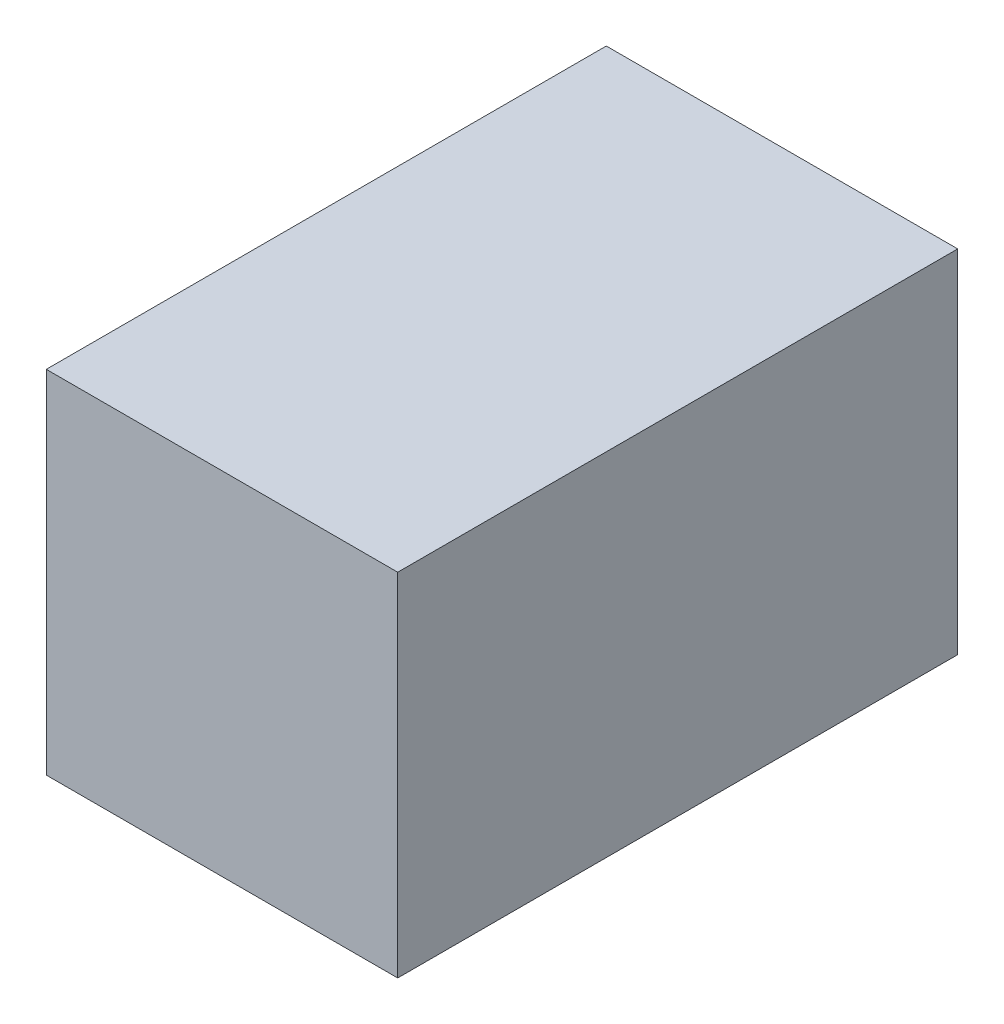
ISO-10303-21;
HEADER;
FILE_DESCRIPTION(('STEP AP214'),'2;1');
FILE_NAME('part.step','',(''),(''),'','','');
FILE_SCHEMA(('AUTOMOTIVE_DESIGN { 1 0 10303 214 1 1 1 1 }'));
ENDSEC;
DATA;
#1=APPLICATION_CONTEXT('core data for automotive mechanical design processes');
#2=APPLICATION_PROTOCOL_DEFINITION('international standard','automotive_design',2000,#1);
#3=PRODUCT_CONTEXT('',#1,'mechanical');
#4=PRODUCT('Part','Part','',(#3));
#5=PRODUCT_RELATED_PRODUCT_CATEGORY('part','',(#4));
#6=PRODUCT_DEFINITION_FORMATION('','',#4);
#7=PRODUCT_DEFINITION_CONTEXT('part definition',#1,'design');
#8=PRODUCT_DEFINITION('design','',#6,#7);
#9=PRODUCT_DEFINITION_SHAPE('','',#8);
#10=(LENGTH_UNIT() NAMED_UNIT(*) SI_UNIT(.MILLI.,.METRE.));
#11=(NAMED_UNIT(*) PLANE_ANGLE_UNIT() SI_UNIT($,.RADIAN.));
#12=(NAMED_UNIT(*) SI_UNIT($,.STERADIAN.) SOLID_ANGLE_UNIT());
#13=UNCERTAINTY_MEASURE_WITH_UNIT(LENGTH_MEASURE(1.E-05),#10,'distance_accuracy_value','');
#14=(GEOMETRIC_REPRESENTATION_CONTEXT(3) GLOBAL_UNCERTAINTY_ASSIGNED_CONTEXT((#13)) GLOBAL_UNIT_ASSIGNED_CONTEXT((#10,
#11,#12)) REPRESENTATION_CONTEXT('',''));
#15=CARTESIAN_POINT('',(0.,0.,0.));
#16=DIRECTION('',(0.,0.,1.));
#17=DIRECTION('',(1.,0.,0.));
#18=AXIS2_PLACEMENT_3D('',#15,#16,#17);
#19=CARTESIAN_POINT('',(50.2045814642449,-50.2045814642449,160.));
#20=DIRECTION('',(-1.,0.,0.));
#21=DIRECTION('',(0.,-1.,0.));
#22=AXIS2_PLACEMENT_3D('',#19,#20,#21);
#23=PLANE('',#22);
#24=DIRECTION('',(0.,1.,0.));
#25=VECTOR('',#24,1.);
#26=CARTESIAN_POINT('',(50.2045814642449,-50.2045814642449,0.));
#27=LINE('',#26,#25);
#28=CARTESIAN_POINT('',(50.2045814642449,-50.2045814642449,0.));
#29=VERTEX_POINT('',#28);
#30=CARTESIAN_POINT('',(50.2045814642449,50.2045814642449,0.));
#31=VERTEX_POINT('',#30);
#32=EDGE_CURVE('E96',#29,#31,#27,.T.);
#33=ORIENTED_EDGE('',*,*,#32,.T.);
#34=DIRECTION('',(0.,0.,-1.));
#35=VECTOR('',#34,1.);
#36=CARTESIAN_POINT('',(50.2045814642449,50.2045814642449,160.));
#37=LINE('',#36,#35);
#38=CARTESIAN_POINT('',(50.2045814642449,50.2045814642449,160.));
#39=VERTEX_POINT('',#38);
#40=EDGE_CURVE('E11',#39,#31,#37,.T.);
#41=ORIENTED_EDGE('',*,*,#40,.F.);
#42=DIRECTION('',(0.,1.,0.));
#43=VECTOR('',#42,1.);
#44=CARTESIAN_POINT('',(50.2045814642449,-50.2045814642449,160.));
#45=LINE('',#44,#43);
#46=CARTESIAN_POINT('',(50.2045814642449,-50.2045814642449,160.));
#47=VERTEX_POINT('',#46);
#48=EDGE_CURVE('E84',#47,#39,#45,.T.);
#49=ORIENTED_EDGE('',*,*,#48,.F.);
#50=DIRECTION('',(0.,0.,-1.));
#51=VECTOR('',#50,1.);
#52=CARTESIAN_POINT('',(50.2045814642449,-50.2045814642449,160.));
#53=LINE('',#52,#51);
#54=EDGE_CURVE('E92',#47,#29,#53,.T.);
#55=ORIENTED_EDGE('',*,*,#54,.T.);
#56=EDGE_LOOP('',(#33,#41,#49,#55));
#57=FACE_BOUND('',#56,.T.);
#58=ADVANCED_FACE('F33',(#57),#23,.F.);
#59=CARTESIAN_POINT('',(50.2045814642449,50.2045814642449,160.));
#60=DIRECTION('',(0.,-1.,0.));
#61=DIRECTION('',(1.,0.,0.));
#62=AXIS2_PLACEMENT_3D('',#59,#60,#61);
#63=PLANE('',#62);
#64=DIRECTION('',(-1.,0.,0.));
#65=VECTOR('',#64,1.);
#66=CARTESIAN_POINT('',(50.2045814642449,50.2045814642449,0.));
#67=LINE('',#66,#65);
#68=CARTESIAN_POINT('',(-50.2045814642449,50.2045814642449,0.));
#69=VERTEX_POINT('',#68);
#70=EDGE_CURVE('E88',#31,#69,#67,.T.);
#71=ORIENTED_EDGE('',*,*,#70,.T.);
#72=DIRECTION('',(0.,0.,-1.));
#73=VECTOR('',#72,1.);
#74=CARTESIAN_POINT('',(-50.2045814642449,50.2045814642449,160.));
#75=LINE('',#74,#73);
#76=CARTESIAN_POINT('',(-50.2045814642449,50.2045814642449,160.));
#77=VERTEX_POINT('',#76);
#78=EDGE_CURVE('E41',#77,#69,#75,.T.);
#79=ORIENTED_EDGE('',*,*,#78,.F.);
#80=DIRECTION('',(-1.,0.,0.));
#81=VECTOR('',#80,1.);
#82=CARTESIAN_POINT('',(50.2045814642449,50.2045814642449,160.));
#83=LINE('',#82,#81);
#84=EDGE_CURVE('E79',#39,#77,#83,.T.);
#85=ORIENTED_EDGE('',*,*,#84,.F.);
#86=ORIENTED_EDGE('',*,*,#40,.T.);
#87=EDGE_LOOP('',(#71,#79,#85,#86));
#88=FACE_BOUND('',#87,.T.);
#89=ADVANCED_FACE('F87',(#88),#63,.F.);
#90=CARTESIAN_POINT('',(-50.2045814642449,50.2045814642449,160.));
#91=DIRECTION('',(1.,0.,0.));
#92=DIRECTION('',(0.,0.,-1.));
#93=AXIS2_PLACEMENT_3D('',#90,#91,#92);
#94=PLANE('',#93);
#95=DIRECTION('',(0.,-1.,0.));
#96=VECTOR('',#95,1.);
#97=CARTESIAN_POINT('',(-50.2045814642449,50.2045814642449,0.));
#98=LINE('',#97,#96);
#99=CARTESIAN_POINT('',(-50.2045814642449,-50.2045814642449,0.));
#100=VERTEX_POINT('',#99);
#101=EDGE_CURVE('E66',#69,#100,#98,.T.);
#102=ORIENTED_EDGE('',*,*,#101,.T.);
#103=DIRECTION('',(0.,0.,-1.));
#104=VECTOR('',#103,1.);
#105=CARTESIAN_POINT('',(-50.2045814642449,-50.2045814642449,160.));
#106=LINE('',#105,#104);
#107=CARTESIAN_POINT('',(-50.2045814642449,-50.2045814642449,160.));
#108=VERTEX_POINT('',#107);
#109=EDGE_CURVE('E89',#108,#100,#106,.T.);
#110=ORIENTED_EDGE('',*,*,#109,.F.);
#111=DIRECTION('',(0.,-1.,0.));
#112=VECTOR('',#111,1.);
#113=CARTESIAN_POINT('',(-50.2045814642449,50.2045814642449,160.));
#114=LINE('',#113,#112);
#115=EDGE_CURVE('E82',#77,#108,#114,.T.);
#116=ORIENTED_EDGE('',*,*,#115,.F.);
#117=ORIENTED_EDGE('',*,*,#78,.T.);
#118=EDGE_LOOP('',(#102,#110,#116,#117));
#119=FACE_BOUND('',#118,.T.);
#120=ADVANCED_FACE('F90',(#119),#94,.F.);
#121=CARTESIAN_POINT('',(-50.2045814642449,-50.2045814642449,160.));
#122=DIRECTION('',(0.,1.,0.));
#123=DIRECTION('',(-1.,0.,0.));
#124=AXIS2_PLACEMENT_3D('',#121,#122,#123);
#125=PLANE('',#124);
#126=DIRECTION('',(1.,0.,0.));
#127=VECTOR('',#126,1.);
#128=CARTESIAN_POINT('',(-50.2045814642449,-50.2045814642449,0.));
#129=LINE('',#128,#127);
#130=EDGE_CURVE('E72',#100,#29,#129,.T.);
#131=ORIENTED_EDGE('',*,*,#130,.T.);
#132=ORIENTED_EDGE('',*,*,#54,.F.);
#133=DIRECTION('',(1.,0.,0.));
#134=VECTOR('',#133,1.);
#135=CARTESIAN_POINT('',(-50.2045814642449,-50.2045814642449,160.));
#136=LINE('',#135,#134);
#137=EDGE_CURVE('E49',#108,#47,#136,.T.);
#138=ORIENTED_EDGE('',*,*,#137,.F.);
#139=ORIENTED_EDGE('',*,*,#109,.T.);
#140=EDGE_LOOP('',(#131,#132,#138,#139));
#141=FACE_BOUND('',#140,.T.);
#142=ADVANCED_FACE('F103',(#141),#125,.F.);
#143=CARTESIAN_POINT('',(0.,0.,160.));
#144=DIRECTION('',(0.,0.,1.));
#145=DIRECTION('',(1.,0.,0.));
#146=AXIS2_PLACEMENT_3D('',#143,#144,#145);
#147=PLANE('',#146);
#148=ORIENTED_EDGE('',*,*,#48,.T.);
#149=ORIENTED_EDGE('',*,*,#84,.T.);
#150=ORIENTED_EDGE('',*,*,#115,.T.);
#151=ORIENTED_EDGE('',*,*,#137,.T.);
#152=EDGE_LOOP('',(#148,#149,#150,#151));
#153=FACE_BOUND('',#152,.T.);
#154=ADVANCED_FACE('F80',(#153),#147,.T.);
#155=CARTESIAN_POINT('',(0.,0.,0.));
#156=DIRECTION('',(0.,0.,1.));
#157=DIRECTION('',(1.,0.,0.));
#158=AXIS2_PLACEMENT_3D('',#155,#156,#157);
#159=PLANE('',#158);
#160=ORIENTED_EDGE('',*,*,#32,.F.);
#161=ORIENTED_EDGE('',*,*,#130,.F.);
#162=ORIENTED_EDGE('',*,*,#101,.F.);
#163=ORIENTED_EDGE('',*,*,#70,.F.);
#164=EDGE_LOOP('',(#160,#161,#162,#163));
#165=FACE_BOUND('',#164,.T.);
#166=ADVANCED_FACE('F106',(#165),#159,.F.);
#167=CLOSED_SHELL('',(#58,#89,#120,#142,#154,#166));
#168=MANIFOLD_SOLID_BREP('B2',#167);
#169=ADVANCED_BREP_SHAPE_REPRESENTATION('',(#18,#168),#14);
#170=SHAPE_DEFINITION_REPRESENTATION(#9,#169);
ENDSEC;
END-ISO-10303-21;
